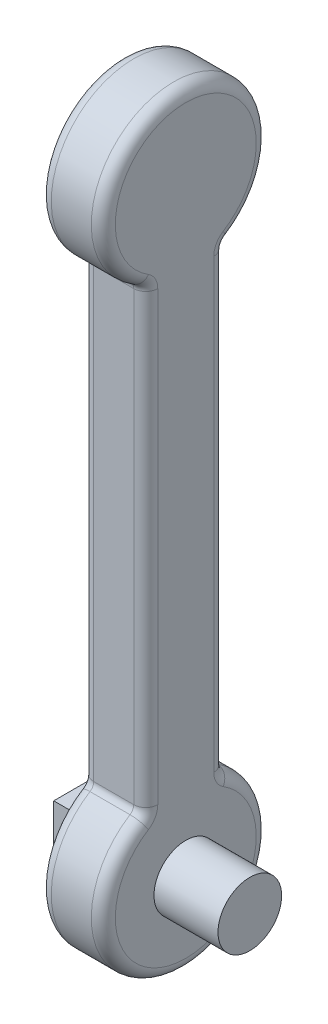
ISO-10303-21;
HEADER;
FILE_DESCRIPTION(('STEP AP214'),'2;1');
FILE_NAME('part.step','',(''),(''),'','','');
FILE_SCHEMA(('AUTOMOTIVE_DESIGN { 1 0 10303 214 1 1 1 1 }'));
ENDSEC;
DATA;
#1=APPLICATION_CONTEXT('core data for automotive mechanical design processes');
#2=APPLICATION_PROTOCOL_DEFINITION('international standard','automotive_design',2000,#1);
#3=PRODUCT_CONTEXT('',#1,'mechanical');
#4=PRODUCT('Part','Part','',(#3));
#5=PRODUCT_RELATED_PRODUCT_CATEGORY('part','',(#4));
#6=PRODUCT_DEFINITION_FORMATION('','',#4);
#7=PRODUCT_DEFINITION_CONTEXT('part definition',#1,'design');
#8=PRODUCT_DEFINITION('design','',#6,#7);
#9=PRODUCT_DEFINITION_SHAPE('','',#8);
#10=(LENGTH_UNIT() NAMED_UNIT(*) SI_UNIT(.MILLI.,.METRE.));
#11=(NAMED_UNIT(*) PLANE_ANGLE_UNIT() SI_UNIT($,.RADIAN.));
#12=(NAMED_UNIT(*) SI_UNIT($,.STERADIAN.) SOLID_ANGLE_UNIT());
#13=UNCERTAINTY_MEASURE_WITH_UNIT(LENGTH_MEASURE(1.E-05),#10,'distance_accuracy_value','');
#14=(GEOMETRIC_REPRESENTATION_CONTEXT(3) GLOBAL_UNCERTAINTY_ASSIGNED_CONTEXT((#13)) GLOBAL_UNIT_ASSIGNED_CONTEXT((#10,
#11,#12)) REPRESENTATION_CONTEXT('',''));
#15=CARTESIAN_POINT('',(0.,0.,0.));
#16=DIRECTION('',(0.,0.,1.));
#17=DIRECTION('',(1.,0.,0.));
#18=AXIS2_PLACEMENT_3D('',#15,#16,#17);
#19=CARTESIAN_POINT('',(0.,0.,0.));
#20=DIRECTION('',(1.,0.,0.));
#21=DIRECTION('',(0.,0.,-1.));
#22=AXIS2_PLACEMENT_3D('',#19,#20,#21);
#23=PLANE('',#22);
#24=CARTESIAN_POINT('',(0.,0.,0.));
#25=DIRECTION('',(1.,0.,0.));
#26=DIRECTION('',(0.,0.,-1.));
#27=AXIS2_PLACEMENT_3D('',#24,#25,#26);
#28=CIRCLE('',#27,8.80364988496194);
#29=CARTESIAN_POINT('',(0.,7.46105683511078,-4.67299499253285));
#30=VERTEX_POINT('',#29);
#31=CARTESIAN_POINT('',(0.,7.46105683511078,4.67299499253285));
#32=VERTEX_POINT('',#31);
#33=EDGE_CURVE('E245',#30,#32,#28,.F.);
#34=ORIENTED_EDGE('',*,*,#33,.T.);
#35=CARTESIAN_POINT('',(0.,9.57979648645002,6.));
#36=DIRECTION('',(1.,0.,0.));
#37=DIRECTION('',(0.,0.,-1.));
#38=AXIS2_PLACEMENT_3D('',#35,#36,#37);
#39=CIRCLE('',#38,2.5);
#40=CARTESIAN_POINT('',(0.,9.57979648645002,3.5));
#41=VERTEX_POINT('',#40);
#42=EDGE_CURVE('E248',#32,#41,#39,.T.);
#43=ORIENTED_EDGE('',*,*,#42,.T.);
#44=DIRECTION('',(0.,-1.,0.));
#45=VECTOR('',#44,1.);
#46=CARTESIAN_POINT('',(0.,0.,3.5));
#47=LINE('',#46,#45);
#48=CARTESIAN_POINT('',(0.,65.42020351355,3.5));
#49=VERTEX_POINT('',#48);
#50=EDGE_CURVE('E227',#41,#49,#47,.F.);
#51=ORIENTED_EDGE('',*,*,#50,.T.);
#52=CARTESIAN_POINT('',(0.,65.42020351355,6.));
#53=DIRECTION('',(1.,0.,0.));
#54=DIRECTION('',(0.,0.,-1.));
#55=AXIS2_PLACEMENT_3D('',#52,#53,#54);
#56=CIRCLE('',#55,2.5);
#57=CARTESIAN_POINT('',(0.,67.5389431648892,4.67299499253284));
#58=VERTEX_POINT('',#57);
#59=EDGE_CURVE('E230',#49,#58,#56,.T.);
#60=ORIENTED_EDGE('',*,*,#59,.T.);
#61=CARTESIAN_POINT('',(0.,75.,0.));
#62=DIRECTION('',(1.,0.,0.));
#63=DIRECTION('',(0.,0.,-1.));
#64=AXIS2_PLACEMENT_3D('',#61,#62,#63);
#65=CIRCLE('',#64,8.80364988496193);
#66=CARTESIAN_POINT('',(0.,67.5389431648892,-4.67299499253285));
#67=VERTEX_POINT('',#66);
#68=EDGE_CURVE('E233',#58,#67,#65,.F.);
#69=ORIENTED_EDGE('',*,*,#68,.T.);
#70=CARTESIAN_POINT('',(0.,65.42020351355,-6.));
#71=DIRECTION('',(1.,0.,0.));
#72=DIRECTION('',(0.,0.,-1.));
#73=AXIS2_PLACEMENT_3D('',#70,#71,#72);
#74=CIRCLE('',#73,2.5);
#75=CARTESIAN_POINT('',(0.,65.42020351355,-3.5));
#76=VERTEX_POINT('',#75);
#77=EDGE_CURVE('E236',#67,#76,#74,.T.);
#78=ORIENTED_EDGE('',*,*,#77,.T.);
#79=DIRECTION('',(0.,1.,0.));
#80=VECTOR('',#79,1.);
#81=CARTESIAN_POINT('',(0.,0.,-3.5));
#82=LINE('',#81,#80);
#83=CARTESIAN_POINT('',(0.,9.57979648645002,-3.5));
#84=VERTEX_POINT('',#83);
#85=EDGE_CURVE('E239',#76,#84,#82,.F.);
#86=ORIENTED_EDGE('',*,*,#85,.T.);
#87=CARTESIAN_POINT('',(0.,9.57979648645002,-6.));
#88=DIRECTION('',(1.,0.,0.));
#89=DIRECTION('',(0.,0.,-1.));
#90=AXIS2_PLACEMENT_3D('',#87,#88,#89);
#91=CIRCLE('',#90,2.5);
#92=EDGE_CURVE('E242',#84,#30,#91,.T.);
#93=ORIENTED_EDGE('',*,*,#92,.T.);
#94=EDGE_LOOP('',(#34,#43,#51,#60,#69,#78,#86,#93));
#95=FACE_BOUND('',#94,.T.);
#96=DIRECTION('',(0.,1.,0.));
#97=VECTOR('',#96,1.);
#98=CARTESIAN_POINT('',(0.,-2.5,2.5));
#99=LINE('',#98,#97);
#100=CARTESIAN_POINT('',(0.,-2.5,2.5));
#101=VERTEX_POINT('',#100);
#102=CARTESIAN_POINT('',(0.,2.5,2.5));
#103=VERTEX_POINT('',#102);
#104=EDGE_CURVE('E192',#101,#103,#99,.T.);
#105=ORIENTED_EDGE('',*,*,#104,.F.);
#106=DIRECTION('',(0.,0.,1.));
#107=VECTOR('',#106,1.);
#108=CARTESIAN_POINT('',(0.,-2.5,-2.5));
#109=LINE('',#108,#107);
#110=CARTESIAN_POINT('',(0.,-2.5,-2.5));
#111=VERTEX_POINT('',#110);
#112=EDGE_CURVE('E189',#111,#101,#109,.T.);
#113=ORIENTED_EDGE('',*,*,#112,.F.);
#114=DIRECTION('',(0.,-1.,0.));
#115=VECTOR('',#114,1.);
#116=CARTESIAN_POINT('',(0.,-2.5,-2.5));
#117=LINE('',#116,#115);
#118=CARTESIAN_POINT('',(0.,2.5,-2.5));
#119=VERTEX_POINT('',#118);
#120=EDGE_CURVE('E56',#119,#111,#117,.T.);
#121=ORIENTED_EDGE('',*,*,#120,.F.);
#122=DIRECTION('',(0.,0.,-1.));
#123=VECTOR('',#122,1.);
#124=CARTESIAN_POINT('',(0.,2.5,-2.5));
#125=LINE('',#124,#123);
#126=EDGE_CURVE('E51',#103,#119,#125,.T.);
#127=ORIENTED_EDGE('',*,*,#126,.F.);
#128=EDGE_LOOP('',(#105,#113,#121,#127));
#129=FACE_BOUND('',#128,.T.);
#130=ADVANCED_FACE('F36',(#95,#129),#23,.F.);
#131=CARTESIAN_POINT('',(6.5,0.,-3.5));
#132=DIRECTION('',(0.,-1.,0.));
#133=DIRECTION('',(0.,0.,-1.));
#134=AXIS2_PLACEMENT_3D('',#131,#132,#133);
#135=CYLINDRICAL_SURFACE('',#134,1.5);
#136=CARTESIAN_POINT('',(6.5,65.42020351355,-3.5));
#137=DIRECTION('',(0.,1.,0.));
#138=DIRECTION('',(0.,0.,1.));
#139=AXIS2_PLACEMENT_3D('',#136,#137,#138);
#140=CIRCLE('',#139,1.5);
#141=CARTESIAN_POINT('',(8.,65.42020351355,-3.5));
#142=VERTEX_POINT('',#141);
#143=CARTESIAN_POINT('',(6.5,65.42020351355,-5.));
#144=VERTEX_POINT('',#143);
#145=EDGE_CURVE('E11',#142,#144,#140,.T.);
#146=ORIENTED_EDGE('',*,*,#145,.F.);
#147=DIRECTION('',(0.,1.,0.));
#148=VECTOR('',#147,1.);
#149=CARTESIAN_POINT('',(8.,0.,-3.5));
#150=LINE('',#149,#148);
#151=CARTESIAN_POINT('',(8.,9.57979648645002,-3.5));
#152=VERTEX_POINT('',#151);
#153=EDGE_CURVE('E288',#152,#142,#150,.T.);
#154=ORIENTED_EDGE('',*,*,#153,.F.);
#155=CARTESIAN_POINT('',(6.5,9.57979648645002,-3.5));
#156=DIRECTION('',(0.,1.,0.));
#157=DIRECTION('',(0.,0.,1.));
#158=AXIS2_PLACEMENT_3D('',#155,#156,#157);
#159=CIRCLE('',#158,1.5);
#160=CARTESIAN_POINT('',(6.5,9.57979648645002,-5.));
#161=VERTEX_POINT('',#160);
#162=EDGE_CURVE('E44',#152,#161,#159,.T.);
#163=ORIENTED_EDGE('',*,*,#162,.T.);
#164=DIRECTION('',(0.,1.,0.));
#165=VECTOR('',#164,1.);
#166=CARTESIAN_POINT('',(6.5,0.,-5.));
#167=LINE('',#166,#165);
#168=EDGE_CURVE('E333',#144,#161,#167,.F.);
#169=ORIENTED_EDGE('',*,*,#168,.F.);
#170=EDGE_LOOP('',(#146,#154,#163,#169));
#171=FACE_BOUND('',#170,.T.);
#172=ADVANCED_FACE('F38',(#171),#135,.T.);
#173=CARTESIAN_POINT('',(6.5,9.57979648645002,-6.));
#174=DIRECTION('',(1.,0.,0.));
#175=DIRECTION('',(0.,0.,-1.));
#176=AXIS2_PLACEMENT_3D('',#173,#174,#175);
#177=TOROIDAL_SURFACE('',#176,2.5,1.5);
#178=ORIENTED_EDGE('',*,*,#162,.F.);
#179=CARTESIAN_POINT('',(8.,9.57979648645002,-6.));
#180=DIRECTION('',(1.,0.,0.));
#181=DIRECTION('',(0.,0.,-1.));
#182=AXIS2_PLACEMENT_3D('',#179,#180,#181);
#183=CIRCLE('',#182,2.5);
#184=CARTESIAN_POINT('',(8.,7.46105683511078,-4.67299499253285));
#185=VERTEX_POINT('',#184);
#186=EDGE_CURVE('E291',#185,#152,#183,.F.);
#187=ORIENTED_EDGE('',*,*,#186,.F.);
#188=CARTESIAN_POINT('',(6.5,7.46105683511078,-4.67299499253285));
#189=DIRECTION('',(0.,0.530802002986861,0.847495860535694));
#190=DIRECTION('',(0.,-0.847495860535694,0.530802002986861));
#191=AXIS2_PLACEMENT_3D('',#188,#189,#190);
#192=CIRCLE('',#191,1.5);
#193=CARTESIAN_POINT('',(6.5,8.73230062591432,-5.46919799701314));
#194=VERTEX_POINT('',#193);
#195=EDGE_CURVE('E346',#185,#194,#192,.T.);
#196=ORIENTED_EDGE('',*,*,#195,.T.);
#197=CARTESIAN_POINT('',(6.5,9.57979648645002,-6.));
#198=DIRECTION('',(1.,0.,0.));
#199=DIRECTION('',(0.,0.,-1.));
#200=AXIS2_PLACEMENT_3D('',#197,#198,#199);
#201=CIRCLE('',#200,1.);
#202=EDGE_CURVE('E330',#161,#194,#201,.T.);
#203=ORIENTED_EDGE('',*,*,#202,.F.);
#204=EDGE_LOOP('',(#178,#187,#196,#203));
#205=FACE_BOUND('',#204,.T.);
#206=ADVANCED_FACE('F358',(#205),#177,.T.);
#207=CARTESIAN_POINT('',(6.5,0.,0.));
#208=DIRECTION('',(1.,0.,0.));
#209=DIRECTION('',(0.,0.,-1.));
#210=AXIS2_PLACEMENT_3D('',#207,#208,#209);
#211=TOROIDAL_SURFACE('',#210,8.80364988496194,1.5);
#212=ORIENTED_EDGE('',*,*,#195,.F.);
#213=CARTESIAN_POINT('',(8.,0.,0.));
#214=DIRECTION('',(1.,0.,0.));
#215=DIRECTION('',(0.,0.,-1.));
#216=AXIS2_PLACEMENT_3D('',#213,#214,#215);
#217=CIRCLE('',#216,8.80364988496194);
#218=CARTESIAN_POINT('',(8.,7.46105683511078,4.67299499253285));
#219=VERTEX_POINT('',#218);
#220=EDGE_CURVE('E294',#219,#185,#217,.T.);
#221=ORIENTED_EDGE('',*,*,#220,.F.);
#222=CARTESIAN_POINT('',(6.5,7.46105683511078,4.67299499253285));
#223=DIRECTION('',(0.,-0.530802002986861,0.847495860535694));
#224=DIRECTION('',(0.,-0.847495860535694,-0.530802002986861));
#225=AXIS2_PLACEMENT_3D('',#222,#223,#224);
#226=CIRCLE('',#225,1.5);
#227=CARTESIAN_POINT('',(6.5,8.73230062591432,5.46919799701314));
#228=VERTEX_POINT('',#227);
#229=EDGE_CURVE('E344',#219,#228,#226,.T.);
#230=ORIENTED_EDGE('',*,*,#229,.T.);
#231=CARTESIAN_POINT('',(6.5,0.,0.));
#232=DIRECTION('',(1.,0.,0.));
#233=DIRECTION('',(0.,0.,-1.));
#234=AXIS2_PLACEMENT_3D('',#231,#232,#233);
#235=CIRCLE('',#234,10.3036498849619);
#236=EDGE_CURVE('E327',#194,#228,#235,.F.);
#237=ORIENTED_EDGE('',*,*,#236,.F.);
#238=EDGE_LOOP('',(#212,#221,#230,#237));
#239=FACE_BOUND('',#238,.T.);
#240=ADVANCED_FACE('F404',(#239),#211,.T.);
#241=CARTESIAN_POINT('',(6.5,9.57979648645002,6.));
#242=DIRECTION('',(1.,0.,0.));
#243=DIRECTION('',(0.,0.,-1.));
#244=AXIS2_PLACEMENT_3D('',#241,#242,#243);
#245=TOROIDAL_SURFACE('',#244,2.5,1.5);
#246=ORIENTED_EDGE('',*,*,#229,.F.);
#247=CARTESIAN_POINT('',(8.,9.57979648645002,6.));
#248=DIRECTION('',(1.,0.,0.));
#249=DIRECTION('',(0.,0.,-1.));
#250=AXIS2_PLACEMENT_3D('',#247,#248,#249);
#251=CIRCLE('',#250,2.5);
#252=CARTESIAN_POINT('',(8.,9.57979648645002,3.5));
#253=VERTEX_POINT('',#252);
#254=EDGE_CURVE('E297',#253,#219,#251,.F.);
#255=ORIENTED_EDGE('',*,*,#254,.F.);
#256=CARTESIAN_POINT('',(6.5,9.57979648645002,3.5));
#257=DIRECTION('',(0.,-1.,0.));
#258=DIRECTION('',(0.,0.,-1.));
#259=AXIS2_PLACEMENT_3D('',#256,#257,#258);
#260=CIRCLE('',#259,1.5);
#261=CARTESIAN_POINT('',(6.5,9.57979648645002,5.));
#262=VERTEX_POINT('',#261);
#263=EDGE_CURVE('E342',#253,#262,#260,.T.);
#264=ORIENTED_EDGE('',*,*,#263,.T.);
#265=CARTESIAN_POINT('',(6.5,9.57979648645002,6.));
#266=DIRECTION('',(1.,0.,0.));
#267=DIRECTION('',(0.,0.,-1.));
#268=AXIS2_PLACEMENT_3D('',#265,#266,#267);
#269=CIRCLE('',#268,1.);
#270=EDGE_CURVE('E324',#228,#262,#269,.T.);
#271=ORIENTED_EDGE('',*,*,#270,.F.);
#272=EDGE_LOOP('',(#246,#255,#264,#271));
#273=FACE_BOUND('',#272,.T.);
#274=ADVANCED_FACE('F407',(#273),#245,.T.);
#275=CARTESIAN_POINT('',(6.5,0.,3.5));
#276=DIRECTION('',(0.,1.,0.));
#277=DIRECTION('',(0.,0.,1.));
#278=AXIS2_PLACEMENT_3D('',#275,#276,#277);
#279=CYLINDRICAL_SURFACE('',#278,1.5);
#280=ORIENTED_EDGE('',*,*,#263,.F.);
#281=DIRECTION('',(0.,-1.,0.));
#282=VECTOR('',#281,1.);
#283=CARTESIAN_POINT('',(8.,0.,3.5));
#284=LINE('',#283,#282);
#285=CARTESIAN_POINT('',(8.,65.42020351355,3.5));
#286=VERTEX_POINT('',#285);
#287=EDGE_CURVE('E300',#286,#253,#284,.T.);
#288=ORIENTED_EDGE('',*,*,#287,.F.);
#289=CARTESIAN_POINT('',(6.5,65.42020351355,3.5));
#290=DIRECTION('',(0.,-1.,0.));
#291=DIRECTION('',(0.,0.,-1.));
#292=AXIS2_PLACEMENT_3D('',#289,#290,#291);
#293=CIRCLE('',#292,1.5);
#294=CARTESIAN_POINT('',(6.5,65.42020351355,5.));
#295=VERTEX_POINT('',#294);
#296=EDGE_CURVE('E340',#286,#295,#293,.T.);
#297=ORIENTED_EDGE('',*,*,#296,.T.);
#298=DIRECTION('',(0.,-1.,0.));
#299=VECTOR('',#298,1.);
#300=CARTESIAN_POINT('',(6.5,0.,5.));
#301=LINE('',#300,#299);
#302=EDGE_CURVE('E321',#262,#295,#301,.F.);
#303=ORIENTED_EDGE('',*,*,#302,.F.);
#304=EDGE_LOOP('',(#280,#288,#297,#303));
#305=FACE_BOUND('',#304,.T.);
#306=ADVANCED_FACE('F410',(#305),#279,.T.);
#307=CARTESIAN_POINT('',(6.5,65.42020351355,6.));
#308=DIRECTION('',(1.,0.,0.));
#309=DIRECTION('',(0.,0.,-1.));
#310=AXIS2_PLACEMENT_3D('',#307,#308,#309);
#311=TOROIDAL_SURFACE('',#310,2.5,1.5);
#312=ORIENTED_EDGE('',*,*,#296,.F.);
#313=CARTESIAN_POINT('',(8.,65.42020351355,6.));
#314=DIRECTION('',(1.,0.,0.));
#315=DIRECTION('',(0.,0.,-1.));
#316=AXIS2_PLACEMENT_3D('',#313,#314,#315);
#317=CIRCLE('',#316,2.5);
#318=CARTESIAN_POINT('',(8.,67.5389431648892,4.67299499253284));
#319=VERTEX_POINT('',#318);
#320=EDGE_CURVE('E303',#319,#286,#317,.F.);
#321=ORIENTED_EDGE('',*,*,#320,.F.);
#322=CARTESIAN_POINT('',(6.5,67.5389431648892,4.67299499253285));
#323=DIRECTION('',(0.,-0.530802002986862,-0.847495860535694));
#324=DIRECTION('',(0.,0.847495860535694,-0.530802002986862));
#325=AXIS2_PLACEMENT_3D('',#322,#323,#324);
#326=CIRCLE('',#325,1.5);
#327=CARTESIAN_POINT('',(6.5,66.2676993740857,5.46919799701314));
#328=VERTEX_POINT('',#327);
#329=EDGE_CURVE('E338',#319,#328,#326,.T.);
#330=ORIENTED_EDGE('',*,*,#329,.T.);
#331=CARTESIAN_POINT('',(6.5,65.42020351355,6.));
#332=DIRECTION('',(1.,0.,0.));
#333=DIRECTION('',(0.,0.,-1.));
#334=AXIS2_PLACEMENT_3D('',#331,#332,#333);
#335=CIRCLE('',#334,1.);
#336=EDGE_CURVE('E318',#295,#328,#335,.T.);
#337=ORIENTED_EDGE('',*,*,#336,.F.);
#338=EDGE_LOOP('',(#312,#321,#330,#337));
#339=FACE_BOUND('',#338,.T.);
#340=ADVANCED_FACE('F603',(#339),#311,.T.);
#341=CARTESIAN_POINT('',(6.5,75.,0.));
#342=DIRECTION('',(1.,0.,0.));
#343=DIRECTION('',(0.,0.,-1.));
#344=AXIS2_PLACEMENT_3D('',#341,#342,#343);
#345=TOROIDAL_SURFACE('',#344,8.80364988496193,1.5);
#346=ORIENTED_EDGE('',*,*,#329,.F.);
#347=CARTESIAN_POINT('',(8.,75.,0.));
#348=DIRECTION('',(1.,0.,0.));
#349=DIRECTION('',(0.,0.,-1.));
#350=AXIS2_PLACEMENT_3D('',#347,#348,#349);
#351=CIRCLE('',#350,8.80364988496193);
#352=CARTESIAN_POINT('',(8.,67.5389431648892,-4.67299499253285));
#353=VERTEX_POINT('',#352);
#354=EDGE_CURVE('E306',#353,#319,#351,.T.);
#355=ORIENTED_EDGE('',*,*,#354,.F.);
#356=CARTESIAN_POINT('',(6.5,67.5389431648892,-4.67299499253284));
#357=DIRECTION('',(0.,0.530802002986864,-0.847495860535692));
#358=DIRECTION('',(0.,0.847495860535692,0.530802002986864));
#359=AXIS2_PLACEMENT_3D('',#356,#357,#358);
#360=CIRCLE('',#359,1.5);
#361=CARTESIAN_POINT('',(6.5,66.2676993740857,-5.46919799701314));
#362=VERTEX_POINT('',#361);
#363=EDGE_CURVE('E336',#353,#362,#360,.T.);
#364=ORIENTED_EDGE('',*,*,#363,.T.);
#365=CARTESIAN_POINT('',(6.5,75.,0.));
#366=DIRECTION('',(1.,0.,0.));
#367=DIRECTION('',(0.,0.,-1.));
#368=AXIS2_PLACEMENT_3D('',#365,#366,#367);
#369=CIRCLE('',#368,10.3036498849619);
#370=EDGE_CURVE('E315',#328,#362,#369,.F.);
#371=ORIENTED_EDGE('',*,*,#370,.F.);
#372=EDGE_LOOP('',(#346,#355,#364,#371));
#373=FACE_BOUND('',#372,.T.);
#374=ADVANCED_FACE('F595',(#373),#345,.T.);
#375=CARTESIAN_POINT('',(6.5,65.42020351355,-6.));
#376=DIRECTION('',(1.,0.,0.));
#377=DIRECTION('',(0.,0.,-1.));
#378=AXIS2_PLACEMENT_3D('',#375,#376,#377);
#379=TOROIDAL_SURFACE('',#378,2.5,1.5);
#380=CARTESIAN_POINT('',(8.,65.42020351355,-6.));
#381=DIRECTION('',(1.,0.,0.));
#382=DIRECTION('',(0.,0.,-1.));
#383=AXIS2_PLACEMENT_3D('',#380,#381,#382);
#384=CIRCLE('',#383,2.5);
#385=EDGE_CURVE('E309',#142,#353,#384,.F.);
#386=ORIENTED_EDGE('',*,*,#385,.F.);
#387=ORIENTED_EDGE('',*,*,#145,.T.);
#388=CARTESIAN_POINT('',(6.5,65.42020351355,-6.));
#389=DIRECTION('',(1.,0.,0.));
#390=DIRECTION('',(0.,0.,-1.));
#391=AXIS2_PLACEMENT_3D('',#388,#389,#390);
#392=CIRCLE('',#391,1.);
#393=EDGE_CURVE('E312',#362,#144,#392,.T.);
#394=ORIENTED_EDGE('',*,*,#393,.F.);
#395=ORIENTED_EDGE('',*,*,#363,.F.);
#396=EDGE_LOOP('',(#386,#387,#394,#395));
#397=FACE_BOUND('',#396,.T.);
#398=ADVANCED_FACE('F396',(#397),#379,.T.);
#399=CARTESIAN_POINT('',(1.5,9.00917315583823,3.5));
#400=DIRECTION('',(0.,-1.,0.));
#401=DIRECTION('',(0.,0.,-1.));
#402=AXIS2_PLACEMENT_3D('',#399,#400,#401);
#403=CYLINDRICAL_SURFACE('',#402,1.5);
#404=CARTESIAN_POINT('',(1.5,9.57979648645002,3.5));
#405=DIRECTION('',(0.,-1.,0.));
#406=DIRECTION('',(0.,0.,-1.));
#407=AXIS2_PLACEMENT_3D('',#404,#405,#406);
#408=CIRCLE('',#407,1.5);
#409=CARTESIAN_POINT('',(1.5,9.57979648645002,5.));
#410=VERTEX_POINT('',#409);
#411=EDGE_CURVE('E286',#410,#41,#408,.T.);
#412=ORIENTED_EDGE('',*,*,#411,.F.);
#413=DIRECTION('',(0.,-1.,0.));
#414=VECTOR('',#413,1.);
#415=CARTESIAN_POINT('',(1.5,9.00917315583823,5.));
#416=LINE('',#415,#414);
#417=CARTESIAN_POINT('',(1.5,65.42020351355,5.));
#418=VERTEX_POINT('',#417);
#419=EDGE_CURVE('E269',#418,#410,#416,.T.);
#420=ORIENTED_EDGE('',*,*,#419,.F.);
#421=CARTESIAN_POINT('',(1.5,65.42020351355,3.5));
#422=DIRECTION('',(0.,-1.,0.));
#423=DIRECTION('',(0.,0.,-1.));
#424=AXIS2_PLACEMENT_3D('',#421,#422,#423);
#425=CIRCLE('',#424,1.5);
#426=EDGE_CURVE('E284',#418,#49,#425,.T.);
#427=ORIENTED_EDGE('',*,*,#426,.T.);
#428=ORIENTED_EDGE('',*,*,#50,.F.);
#429=EDGE_LOOP('',(#412,#420,#427,#428));
#430=FACE_BOUND('',#429,.T.);
#431=ADVANCED_FACE('F419',(#430),#403,.T.);
#432=CARTESIAN_POINT('',(1.5,65.42020351355,6.));
#433=DIRECTION('',(1.,0.,0.));
#434=DIRECTION('',(0.,0.,-1.));
#435=AXIS2_PLACEMENT_3D('',#432,#433,#434);
#436=TOROIDAL_SURFACE('',#435,2.5,1.5);
#437=ORIENTED_EDGE('',*,*,#426,.F.);
#438=CARTESIAN_POINT('',(1.5,65.42020351355,6.));
#439=DIRECTION('',(1.,0.,0.));
#440=DIRECTION('',(0.,0.,-1.));
#441=AXIS2_PLACEMENT_3D('',#438,#439,#440);
#442=CIRCLE('',#441,1.);
#443=CARTESIAN_POINT('',(1.5,66.2676993740857,5.46919799701314));
#444=VERTEX_POINT('',#443);
#445=EDGE_CURVE('E266',#444,#418,#442,.F.);
#446=ORIENTED_EDGE('',*,*,#445,.F.);
#447=CARTESIAN_POINT('',(1.5,67.5389431648892,4.67299499253285));
#448=DIRECTION('',(0.,-0.530802002986862,-0.847495860535694));
#449=DIRECTION('',(0.,0.847495860535694,-0.530802002986862));
#450=AXIS2_PLACEMENT_3D('',#447,#448,#449);
#451=CIRCLE('',#450,1.5);
#452=EDGE_CURVE('E282',#444,#58,#451,.T.);
#453=ORIENTED_EDGE('',*,*,#452,.T.);
#454=ORIENTED_EDGE('',*,*,#59,.F.);
#455=EDGE_LOOP('',(#437,#446,#453,#454));
#456=FACE_BOUND('',#455,.T.);
#457=ADVANCED_FACE('F426',(#456),#436,.T.);
#458=CARTESIAN_POINT('',(1.5,75.,0.));
#459=DIRECTION('',(1.,0.,0.));
#460=DIRECTION('',(0.,0.,-1.));
#461=AXIS2_PLACEMENT_3D('',#458,#459,#460);
#462=TOROIDAL_SURFACE('',#461,8.80364988496193,1.5);
#463=ORIENTED_EDGE('',*,*,#452,.F.);
#464=CARTESIAN_POINT('',(1.5,75.,0.));
#465=DIRECTION('',(1.,0.,0.));
#466=DIRECTION('',(0.,0.,-1.));
#467=AXIS2_PLACEMENT_3D('',#464,#465,#466);
#468=CIRCLE('',#467,10.3036498849619);
#469=CARTESIAN_POINT('',(1.5,66.2676993740857,-5.46919799701314));
#470=VERTEX_POINT('',#469);
#471=EDGE_CURVE('E263',#470,#444,#468,.T.);
#472=ORIENTED_EDGE('',*,*,#471,.F.);
#473=CARTESIAN_POINT('',(1.5,67.5389431648892,-4.67299499253284));
#474=DIRECTION('',(0.,0.530802002986864,-0.847495860535692));
#475=DIRECTION('',(0.,0.847495860535692,0.530802002986864));
#476=AXIS2_PLACEMENT_3D('',#473,#474,#475);
#477=CIRCLE('',#476,1.5);
#478=EDGE_CURVE('E280',#470,#67,#477,.T.);
#479=ORIENTED_EDGE('',*,*,#478,.T.);
#480=ORIENTED_EDGE('',*,*,#68,.F.);
#481=EDGE_LOOP('',(#463,#472,#479,#480));
#482=FACE_BOUND('',#481,.T.);
#483=ADVANCED_FACE('F433',(#482),#462,.T.);
#484=CARTESIAN_POINT('',(1.5,65.42020351355,-6.));
#485=DIRECTION('',(1.,0.,0.));
#486=DIRECTION('',(0.,0.,-1.));
#487=AXIS2_PLACEMENT_3D('',#484,#485,#486);
#488=TOROIDAL_SURFACE('',#487,2.5,1.5);
#489=ORIENTED_EDGE('',*,*,#478,.F.);
#490=CARTESIAN_POINT('',(1.5,65.42020351355,-6.));
#491=DIRECTION('',(1.,0.,0.));
#492=DIRECTION('',(0.,0.,-1.));
#493=AXIS2_PLACEMENT_3D('',#490,#491,#492);
#494=CIRCLE('',#493,1.);
#495=CARTESIAN_POINT('',(1.5,65.42020351355,-5.));
#496=VERTEX_POINT('',#495);
#497=EDGE_CURVE('E260',#496,#470,#494,.F.);
#498=ORIENTED_EDGE('',*,*,#497,.F.);
#499=CARTESIAN_POINT('',(1.5,65.42020351355,-3.5));
#500=DIRECTION('',(0.,1.,0.));
#501=DIRECTION('',(0.,0.,1.));
#502=AXIS2_PLACEMENT_3D('',#499,#500,#501);
#503=CIRCLE('',#502,1.5);
#504=EDGE_CURVE('E278',#496,#76,#503,.T.);
#505=ORIENTED_EDGE('',*,*,#504,.T.);
#506=ORIENTED_EDGE('',*,*,#77,.F.);
#507=EDGE_LOOP('',(#489,#498,#505,#506));
#508=FACE_BOUND('',#507,.T.);
#509=ADVANCED_FACE('F435',(#508),#488,.T.);
#510=CARTESIAN_POINT('',(1.5,9.00917315583823,-3.5));
#511=DIRECTION('',(0.,1.,0.));
#512=DIRECTION('',(0.,0.,1.));
#513=AXIS2_PLACEMENT_3D('',#510,#511,#512);
#514=CYLINDRICAL_SURFACE('',#513,1.5);
#515=ORIENTED_EDGE('',*,*,#504,.F.);
#516=DIRECTION('',(0.,1.,0.));
#517=VECTOR('',#516,1.);
#518=CARTESIAN_POINT('',(1.5,9.00917315583823,-5.));
#519=LINE('',#518,#517);
#520=CARTESIAN_POINT('',(1.5,9.57979648645002,-5.));
#521=VERTEX_POINT('',#520);
#522=EDGE_CURVE('E257',#521,#496,#519,.T.);
#523=ORIENTED_EDGE('',*,*,#522,.F.);
#524=CARTESIAN_POINT('',(1.5,9.57979648645002,-3.5));
#525=DIRECTION('',(0.,1.,0.));
#526=DIRECTION('',(0.,0.,1.));
#527=AXIS2_PLACEMENT_3D('',#524,#525,#526);
#528=CIRCLE('',#527,1.5);
#529=EDGE_CURVE('E276',#521,#84,#528,.T.);
#530=ORIENTED_EDGE('',*,*,#529,.T.);
#531=ORIENTED_EDGE('',*,*,#85,.F.);
#532=EDGE_LOOP('',(#515,#523,#530,#531));
#533=FACE_BOUND('',#532,.T.);
#534=ADVANCED_FACE('F388',(#533),#514,.T.);
#535=CARTESIAN_POINT('',(1.5,9.57979648645002,-6.));
#536=DIRECTION('',(1.,0.,0.));
#537=DIRECTION('',(0.,0.,-1.));
#538=AXIS2_PLACEMENT_3D('',#535,#536,#537);
#539=TOROIDAL_SURFACE('',#538,2.5,1.5);
#540=ORIENTED_EDGE('',*,*,#529,.F.);
#541=CARTESIAN_POINT('',(1.5,9.57979648645002,-6.));
#542=DIRECTION('',(1.,0.,0.));
#543=DIRECTION('',(0.,0.,-1.));
#544=AXIS2_PLACEMENT_3D('',#541,#542,#543);
#545=CIRCLE('',#544,1.);
#546=CARTESIAN_POINT('',(1.5,8.73230062591432,-5.46919799701314));
#547=VERTEX_POINT('',#546);
#548=EDGE_CURVE('E254',#547,#521,#545,.F.);
#549=ORIENTED_EDGE('',*,*,#548,.F.);
#550=CARTESIAN_POINT('',(1.5,7.46105683511078,-4.67299499253285));
#551=DIRECTION('',(0.,0.530802002986861,0.847495860535694));
#552=DIRECTION('',(0.,-0.847495860535694,0.530802002986861));
#553=AXIS2_PLACEMENT_3D('',#550,#551,#552);
#554=CIRCLE('',#553,1.5);
#555=EDGE_CURVE('E274',#547,#30,#554,.T.);
#556=ORIENTED_EDGE('',*,*,#555,.T.);
#557=ORIENTED_EDGE('',*,*,#92,.F.);
#558=EDGE_LOOP('',(#540,#549,#556,#557));
#559=FACE_BOUND('',#558,.T.);
#560=ADVANCED_FACE('F365',(#559),#539,.T.);
#561=CARTESIAN_POINT('',(1.5,0.,0.));
#562=DIRECTION('',(1.,0.,0.));
#563=DIRECTION('',(0.,0.,-1.));
#564=AXIS2_PLACEMENT_3D('',#561,#562,#563);
#565=TOROIDAL_SURFACE('',#564,8.80364988496194,1.5);
#566=ORIENTED_EDGE('',*,*,#555,.F.);
#567=CARTESIAN_POINT('',(1.5,0.,0.));
#568=DIRECTION('',(1.,0.,0.));
#569=DIRECTION('',(0.,0.,-1.));
#570=AXIS2_PLACEMENT_3D('',#567,#568,#569);
#571=CIRCLE('',#570,10.3036498849619);
#572=CARTESIAN_POINT('',(1.5,8.73230062591432,5.46919799701314));
#573=VERTEX_POINT('',#572);
#574=EDGE_CURVE('E251',#573,#547,#571,.T.);
#575=ORIENTED_EDGE('',*,*,#574,.F.);
#576=CARTESIAN_POINT('',(1.5,7.46105683511078,4.67299499253285));
#577=DIRECTION('',(0.,-0.53080200298686,0.847495860535694));
#578=DIRECTION('',(0.,-0.847495860535694,-0.530802002986861));
#579=AXIS2_PLACEMENT_3D('',#576,#577,#578);
#580=CIRCLE('',#579,1.5);
#581=EDGE_CURVE('E272',#573,#32,#580,.T.);
#582=ORIENTED_EDGE('',*,*,#581,.T.);
#583=ORIENTED_EDGE('',*,*,#33,.F.);
#584=EDGE_LOOP('',(#566,#575,#582,#583));
#585=FACE_BOUND('',#584,.T.);
#586=ADVANCED_FACE('F375',(#585),#565,.T.);
#587=CARTESIAN_POINT('',(1.5,9.57979648645002,6.));
#588=DIRECTION('',(1.,0.,0.));
#589=DIRECTION('',(0.,0.,-1.));
#590=AXIS2_PLACEMENT_3D('',#587,#588,#589);
#591=TOROIDAL_SURFACE('',#590,2.5,1.5);
#592=CARTESIAN_POINT('',(1.5,9.57979648645002,6.));
#593=DIRECTION('',(1.,0.,0.));
#594=DIRECTION('',(0.,0.,-1.));
#595=AXIS2_PLACEMENT_3D('',#592,#593,#594);
#596=CIRCLE('',#595,1.);
#597=EDGE_CURVE('E224',#410,#573,#596,.F.);
#598=ORIENTED_EDGE('',*,*,#597,.F.);
#599=ORIENTED_EDGE('',*,*,#411,.T.);
#600=ORIENTED_EDGE('',*,*,#42,.F.);
#601=ORIENTED_EDGE('',*,*,#581,.F.);
#602=EDGE_LOOP('',(#598,#599,#600,#601));
#603=FACE_BOUND('',#602,.T.);
#604=ADVANCED_FACE('F382',(#603),#591,.T.);
#605=CARTESIAN_POINT('',(8.,0.,0.));
#606=DIRECTION('',(1.,0.,0.));
#607=DIRECTION('',(0.,0.,-1.));
#608=AXIS2_PLACEMENT_3D('',#605,#606,#607);
#609=PLANE('',#608);
#610=ORIENTED_EDGE('',*,*,#153,.T.);
#611=ORIENTED_EDGE('',*,*,#385,.T.);
#612=ORIENTED_EDGE('',*,*,#354,.T.);
#613=ORIENTED_EDGE('',*,*,#320,.T.);
#614=ORIENTED_EDGE('',*,*,#287,.T.);
#615=ORIENTED_EDGE('',*,*,#254,.T.);
#616=ORIENTED_EDGE('',*,*,#220,.T.);
#617=ORIENTED_EDGE('',*,*,#186,.T.);
#618=EDGE_LOOP('',(#610,#611,#612,#613,#614,#615,#616,#617));
#619=FACE_BOUND('',#618,.T.);
#620=CARTESIAN_POINT('',(8.,0.,0.));
#621=DIRECTION('',(1.,0.,0.));
#622=DIRECTION('',(0.,0.,-1.));
#623=AXIS2_PLACEMENT_3D('',#620,#621,#622);
#624=CIRCLE('',#623,3.975);
#625=CARTESIAN_POINT('',(8.,0.,-3.975));
#626=VERTEX_POINT('',#625);
#627=EDGE_CURVE('E193',#626,#626,#624,.T.);
#628=ORIENTED_EDGE('',*,*,#627,.F.);
#629=EDGE_LOOP('',(#628));
#630=FACE_BOUND('',#629,.T.);
#631=ADVANCED_FACE('F399',(#619,#630),#609,.T.);
#632=CARTESIAN_POINT('',(8.,0.,0.));
#633=DIRECTION('',(-1.,0.,0.));
#634=DIRECTION('',(0.,0.,1.));
#635=AXIS2_PLACEMENT_3D('',#632,#633,#634);
#636=CYLINDRICAL_SURFACE('',#635,10.3036498849619);
#637=DIRECTION('',(-1.,0.,0.));
#638=VECTOR('',#637,1.);
#639=CARTESIAN_POINT('',(8.,8.73230062591432,-5.46919799701314));
#640=LINE('',#639,#638);
#641=EDGE_CURVE('E221',#547,#194,#640,.F.);
#642=ORIENTED_EDGE('',*,*,#641,.T.);
#643=ORIENTED_EDGE('',*,*,#236,.T.);
#644=DIRECTION('',(-1.,0.,0.));
#645=VECTOR('',#644,1.);
#646=CARTESIAN_POINT('',(8.,8.73230062591432,5.46919799701314));
#647=LINE('',#646,#645);
#648=EDGE_CURVE('E217',#228,#573,#647,.T.);
#649=ORIENTED_EDGE('',*,*,#648,.T.);
#650=ORIENTED_EDGE('',*,*,#574,.T.);
#651=EDGE_LOOP('',(#642,#643,#649,#650));
#652=FACE_BOUND('',#651,.T.);
#653=ADVANCED_FACE('F371',(#652),#636,.T.);
#654=CARTESIAN_POINT('',(8.,9.00917315583823,-5.));
#655=DIRECTION('',(0.,0.,1.));
#656=DIRECTION('',(1.,0.,0.));
#657=AXIS2_PLACEMENT_3D('',#654,#655,#656);
#658=PLANE('',#657);
#659=DIRECTION('',(1.,0.,0.));
#660=VECTOR('',#659,1.);
#661=CARTESIAN_POINT('',(7.,65.42020351355,-5.));
#662=LINE('',#661,#660);
#663=EDGE_CURVE('E203',#496,#144,#662,.T.);
#664=ORIENTED_EDGE('',*,*,#663,.T.);
#665=ORIENTED_EDGE('',*,*,#168,.T.);
#666=DIRECTION('',(1.,0.,0.));
#667=VECTOR('',#666,1.);
#668=CARTESIAN_POINT('',(1.,9.57979648645002,-5.));
#669=LINE('',#668,#667);
#670=EDGE_CURVE('E219',#161,#521,#669,.F.);
#671=ORIENTED_EDGE('',*,*,#670,.T.);
#672=ORIENTED_EDGE('',*,*,#522,.T.);
#673=EDGE_LOOP('',(#664,#665,#671,#672));
#674=FACE_BOUND('',#673,.T.);
#675=ADVANCED_FACE('F354',(#674),#658,.F.);
#676=CARTESIAN_POINT('',(8.,75.,0.));
#677=DIRECTION('',(-1.,0.,0.));
#678=DIRECTION('',(0.,0.,1.));
#679=AXIS2_PLACEMENT_3D('',#676,#677,#678);
#680=CYLINDRICAL_SURFACE('',#679,10.3036498849619);
#681=DIRECTION('',(-1.,0.,0.));
#682=VECTOR('',#681,1.);
#683=CARTESIAN_POINT('',(8.,66.2676993740857,5.46919799701314));
#684=LINE('',#683,#682);
#685=EDGE_CURVE('E211',#444,#328,#684,.F.);
#686=ORIENTED_EDGE('',*,*,#685,.T.);
#687=ORIENTED_EDGE('',*,*,#370,.T.);
#688=DIRECTION('',(-1.,0.,0.));
#689=VECTOR('',#688,1.);
#690=CARTESIAN_POINT('',(8.,66.2676993740857,-5.46919799701314));
#691=LINE('',#690,#689);
#692=EDGE_CURVE('E207',#362,#470,#691,.T.);
#693=ORIENTED_EDGE('',*,*,#692,.T.);
#694=ORIENTED_EDGE('',*,*,#471,.T.);
#695=EDGE_LOOP('',(#686,#687,#693,#694));
#696=FACE_BOUND('',#695,.T.);
#697=ADVANCED_FACE('F430',(#696),#680,.T.);
#698=CARTESIAN_POINT('',(8.,9.00917315583823,5.));
#699=DIRECTION('',(0.,0.,-1.));
#700=DIRECTION('',(-1.,0.,0.));
#701=AXIS2_PLACEMENT_3D('',#698,#699,#700);
#702=PLANE('',#701);
#703=DIRECTION('',(1.,0.,0.));
#704=VECTOR('',#703,1.);
#705=CARTESIAN_POINT('',(7.,9.57979648645002,5.));
#706=LINE('',#705,#704);
#707=EDGE_CURVE('E214',#410,#262,#706,.T.);
#708=ORIENTED_EDGE('',*,*,#707,.T.);
#709=ORIENTED_EDGE('',*,*,#302,.T.);
#710=DIRECTION('',(1.,0.,0.));
#711=VECTOR('',#710,1.);
#712=CARTESIAN_POINT('',(1.,65.42020351355,5.));
#713=LINE('',#712,#711);
#714=EDGE_CURVE('E209',#295,#418,#713,.F.);
#715=ORIENTED_EDGE('',*,*,#714,.T.);
#716=ORIENTED_EDGE('',*,*,#419,.T.);
#717=EDGE_LOOP('',(#708,#709,#715,#716));
#718=FACE_BOUND('',#717,.T.);
#719=ADVANCED_FACE('F414',(#718),#702,.F.);
#720=CARTESIAN_POINT('',(16.,0.,0.));
#721=DIRECTION('',(-1.,0.,0.));
#722=DIRECTION('',(0.,0.,1.));
#723=AXIS2_PLACEMENT_3D('',#720,#721,#722);
#724=CYLINDRICAL_SURFACE('',#723,3.975);
#725=CARTESIAN_POINT('',(16.,0.,0.));
#726=DIRECTION('',(1.,0.,0.));
#727=DIRECTION('',(0.,0.,-1.));
#728=AXIS2_PLACEMENT_3D('',#725,#726,#727);
#729=CIRCLE('',#728,3.975);
#730=CARTESIAN_POINT('',(16.,0.,-3.975));
#731=VERTEX_POINT('',#730);
#732=EDGE_CURVE('E196',#731,#731,#729,.T.);
#733=ORIENTED_EDGE('',*,*,#732,.F.);
#734=EDGE_LOOP('',(#733));
#735=FACE_BOUND('',#734,.T.);
#736=ORIENTED_EDGE('',*,*,#627,.T.);
#737=EDGE_LOOP('',(#736));
#738=FACE_BOUND('',#737,.T.);
#739=ADVANCED_FACE('F454',(#735,#738),#724,.T.);
#740=CARTESIAN_POINT('',(16.,0.,0.));
#741=DIRECTION('',(1.,0.,0.));
#742=DIRECTION('',(0.,0.,-1.));
#743=AXIS2_PLACEMENT_3D('',#740,#741,#742);
#744=PLANE('',#743);
#745=ORIENTED_EDGE('',*,*,#732,.T.);
#746=EDGE_LOOP('',(#745));
#747=FACE_BOUND('',#746,.T.);
#748=ADVANCED_FACE('F463',(#747),#744,.T.);
#749=CARTESIAN_POINT('',(8.,65.42020351355,-6.));
#750=DIRECTION('',(-1.,0.,0.));
#751=DIRECTION('',(0.,0.,1.));
#752=AXIS2_PLACEMENT_3D('',#749,#750,#751);
#753=CYLINDRICAL_SURFACE('',#752,1.);
#754=ORIENTED_EDGE('',*,*,#692,.F.);
#755=ORIENTED_EDGE('',*,*,#393,.T.);
#756=ORIENTED_EDGE('',*,*,#663,.F.);
#757=ORIENTED_EDGE('',*,*,#497,.T.);
#758=EDGE_LOOP('',(#754,#755,#756,#757));
#759=FACE_BOUND('',#758,.T.);
#760=ADVANCED_FACE('F392',(#759),#753,.F.);
#761=CARTESIAN_POINT('',(8.,65.42020351355,6.));
#762=DIRECTION('',(-1.,0.,0.));
#763=DIRECTION('',(0.,0.,1.));
#764=AXIS2_PLACEMENT_3D('',#761,#762,#763);
#765=CYLINDRICAL_SURFACE('',#764,1.);
#766=ORIENTED_EDGE('',*,*,#714,.F.);
#767=ORIENTED_EDGE('',*,*,#336,.T.);
#768=ORIENTED_EDGE('',*,*,#685,.F.);
#769=ORIENTED_EDGE('',*,*,#445,.T.);
#770=EDGE_LOOP('',(#766,#767,#768,#769));
#771=FACE_BOUND('',#770,.T.);
#772=ADVANCED_FACE('F424',(#771),#765,.F.);
#773=CARTESIAN_POINT('',(8.,9.57979648645002,6.));
#774=DIRECTION('',(-1.,0.,0.));
#775=DIRECTION('',(0.,0.,1.));
#776=AXIS2_PLACEMENT_3D('',#773,#774,#775);
#777=CYLINDRICAL_SURFACE('',#776,1.);
#778=ORIENTED_EDGE('',*,*,#648,.F.);
#779=ORIENTED_EDGE('',*,*,#270,.T.);
#780=ORIENTED_EDGE('',*,*,#707,.F.);
#781=ORIENTED_EDGE('',*,*,#597,.T.);
#782=EDGE_LOOP('',(#778,#779,#780,#781));
#783=FACE_BOUND('',#782,.T.);
#784=ADVANCED_FACE('F380',(#783),#777,.F.);
#785=CARTESIAN_POINT('',(8.,9.57979648645002,-6.));
#786=DIRECTION('',(-1.,0.,0.));
#787=DIRECTION('',(0.,0.,1.));
#788=AXIS2_PLACEMENT_3D('',#785,#786,#787);
#789=CYLINDRICAL_SURFACE('',#788,1.);
#790=ORIENTED_EDGE('',*,*,#670,.F.);
#791=ORIENTED_EDGE('',*,*,#202,.T.);
#792=ORIENTED_EDGE('',*,*,#641,.F.);
#793=ORIENTED_EDGE('',*,*,#548,.T.);
#794=EDGE_LOOP('',(#790,#791,#792,#793));
#795=FACE_BOUND('',#794,.T.);
#796=ADVANCED_FACE('F362',(#795),#789,.F.);
#797=CARTESIAN_POINT('',(-6.,-2.5,2.5));
#798=DIRECTION('',(0.,0.,-1.));
#799=DIRECTION('',(-1.,0.,0.));
#800=AXIS2_PLACEMENT_3D('',#797,#798,#799);
#801=PLANE('',#800);
#802=ORIENTED_EDGE('',*,*,#104,.T.);
#803=DIRECTION('',(1.,0.,0.));
#804=VECTOR('',#803,1.);
#805=CARTESIAN_POINT('',(-6.,2.5,2.5));
#806=LINE('',#805,#804);
#807=CARTESIAN_POINT('',(-6.,2.5,2.5));
#808=VERTEX_POINT('',#807);
#809=EDGE_CURVE('E173',#808,#103,#806,.T.);
#810=ORIENTED_EDGE('',*,*,#809,.F.);
#811=DIRECTION('',(0.,1.,0.));
#812=VECTOR('',#811,1.);
#813=CARTESIAN_POINT('',(-6.,-2.5,2.5));
#814=LINE('',#813,#812);
#815=CARTESIAN_POINT('',(-6.,-2.5,2.5));
#816=VERTEX_POINT('',#815);
#817=EDGE_CURVE('E180',#816,#808,#814,.T.);
#818=ORIENTED_EDGE('',*,*,#817,.F.);
#819=DIRECTION('',(1.,0.,0.));
#820=VECTOR('',#819,1.);
#821=CARTESIAN_POINT('',(-6.,-2.5,2.5));
#822=LINE('',#821,#820);
#823=EDGE_CURVE('E714',#816,#101,#822,.T.);
#824=ORIENTED_EDGE('',*,*,#823,.T.);
#825=EDGE_LOOP('',(#802,#810,#818,#824));
#826=FACE_BOUND('',#825,.T.);
#827=ADVANCED_FACE('F191',(#826),#801,.F.);
#828=CARTESIAN_POINT('',(-6.,2.5,-2.5));
#829=DIRECTION('',(0.,-1.,0.));
#830=DIRECTION('',(0.,0.,-1.));
#831=AXIS2_PLACEMENT_3D('',#828,#829,#830);
#832=PLANE('',#831);
#833=ORIENTED_EDGE('',*,*,#126,.T.);
#834=DIRECTION('',(1.,0.,0.));
#835=VECTOR('',#834,1.);
#836=CARTESIAN_POINT('',(-6.,2.5,-2.5));
#837=LINE('',#836,#835);
#838=CARTESIAN_POINT('',(-6.,2.5,-2.5));
#839=VERTEX_POINT('',#838);
#840=EDGE_CURVE('E176',#839,#119,#837,.T.);
#841=ORIENTED_EDGE('',*,*,#840,.F.);
#842=DIRECTION('',(0.,0.,-1.));
#843=VECTOR('',#842,1.);
#844=CARTESIAN_POINT('',(-6.,2.5,-2.5));
#845=LINE('',#844,#843);
#846=EDGE_CURVE('E169',#808,#839,#845,.T.);
#847=ORIENTED_EDGE('',*,*,#846,.F.);
#848=ORIENTED_EDGE('',*,*,#809,.T.);
#849=EDGE_LOOP('',(#833,#841,#847,#848));
#850=FACE_BOUND('',#849,.T.);
#851=ADVANCED_FACE('F171',(#850),#832,.F.);
#852=CARTESIAN_POINT('',(-6.,-2.5,-2.5));
#853=DIRECTION('',(0.,0.,1.));
#854=DIRECTION('',(1.,0.,0.));
#855=AXIS2_PLACEMENT_3D('',#852,#853,#854);
#856=PLANE('',#855);
#857=ORIENTED_EDGE('',*,*,#120,.T.);
#858=DIRECTION('',(1.,0.,0.));
#859=VECTOR('',#858,1.);
#860=CARTESIAN_POINT('',(-6.,-2.5,-2.5));
#861=LINE('',#860,#859);
#862=CARTESIAN_POINT('',(-6.,-2.5,-2.5));
#863=VERTEX_POINT('',#862);
#864=EDGE_CURVE('E198',#863,#111,#861,.T.);
#865=ORIENTED_EDGE('',*,*,#864,.F.);
#866=DIRECTION('',(0.,-1.,0.));
#867=VECTOR('',#866,1.);
#868=CARTESIAN_POINT('',(-6.,-2.5,-2.5));
#869=LINE('',#868,#867);
#870=EDGE_CURVE('E179',#839,#863,#869,.T.);
#871=ORIENTED_EDGE('',*,*,#870,.F.);
#872=ORIENTED_EDGE('',*,*,#840,.T.);
#873=EDGE_LOOP('',(#857,#865,#871,#872));
#874=FACE_BOUND('',#873,.T.);
#875=ADVANCED_FACE('F552',(#874),#856,.F.);
#876=CARTESIAN_POINT('',(-6.,-2.5,-2.5));
#877=DIRECTION('',(0.,1.,0.));
#878=DIRECTION('',(0.,0.,1.));
#879=AXIS2_PLACEMENT_3D('',#876,#877,#878);
#880=PLANE('',#879);
#881=ORIENTED_EDGE('',*,*,#112,.T.);
#882=ORIENTED_EDGE('',*,*,#823,.F.);
#883=DIRECTION('',(0.,0.,1.));
#884=VECTOR('',#883,1.);
#885=CARTESIAN_POINT('',(-6.,-2.5,-2.5));
#886=LINE('',#885,#884);
#887=EDGE_CURVE('E185',#863,#816,#886,.T.);
#888=ORIENTED_EDGE('',*,*,#887,.F.);
#889=ORIENTED_EDGE('',*,*,#864,.T.);
#890=EDGE_LOOP('',(#881,#882,#888,#889));
#891=FACE_BOUND('',#890,.T.);
#892=ADVANCED_FACE('F559',(#891),#880,.F.);
#893=CARTESIAN_POINT('',(-6.,0.,0.));
#894=DIRECTION('',(1.,0.,0.));
#895=DIRECTION('',(0.,0.,-1.));
#896=AXIS2_PLACEMENT_3D('',#893,#894,#895);
#897=PLANE('',#896);
#898=ORIENTED_EDGE('',*,*,#817,.T.);
#899=ORIENTED_EDGE('',*,*,#846,.T.);
#900=ORIENTED_EDGE('',*,*,#870,.T.);
#901=ORIENTED_EDGE('',*,*,#887,.T.);
#902=EDGE_LOOP('',(#898,#899,#900,#901));
#903=FACE_BOUND('',#902,.T.);
#904=ADVANCED_FACE('F183',(#903),#897,.F.);
#905=CLOSED_SHELL('',(#130,#172,#206,#240,#274,#306,#340,#374,#398,#431,#457,#483,#509,#534,
#560,#586,#604,#631,#653,#675,#697,#719,#739,#748,#760,#772,#784,#796,#827,#851,#875,#892,#904));
#906=MANIFOLD_SOLID_BREP('B2',#905);
#907=ADVANCED_BREP_SHAPE_REPRESENTATION('',(#18,#906),#14);
#908=SHAPE_DEFINITION_REPRESENTATION(#9,#907);
ENDSEC;
END-ISO-10303-21;
